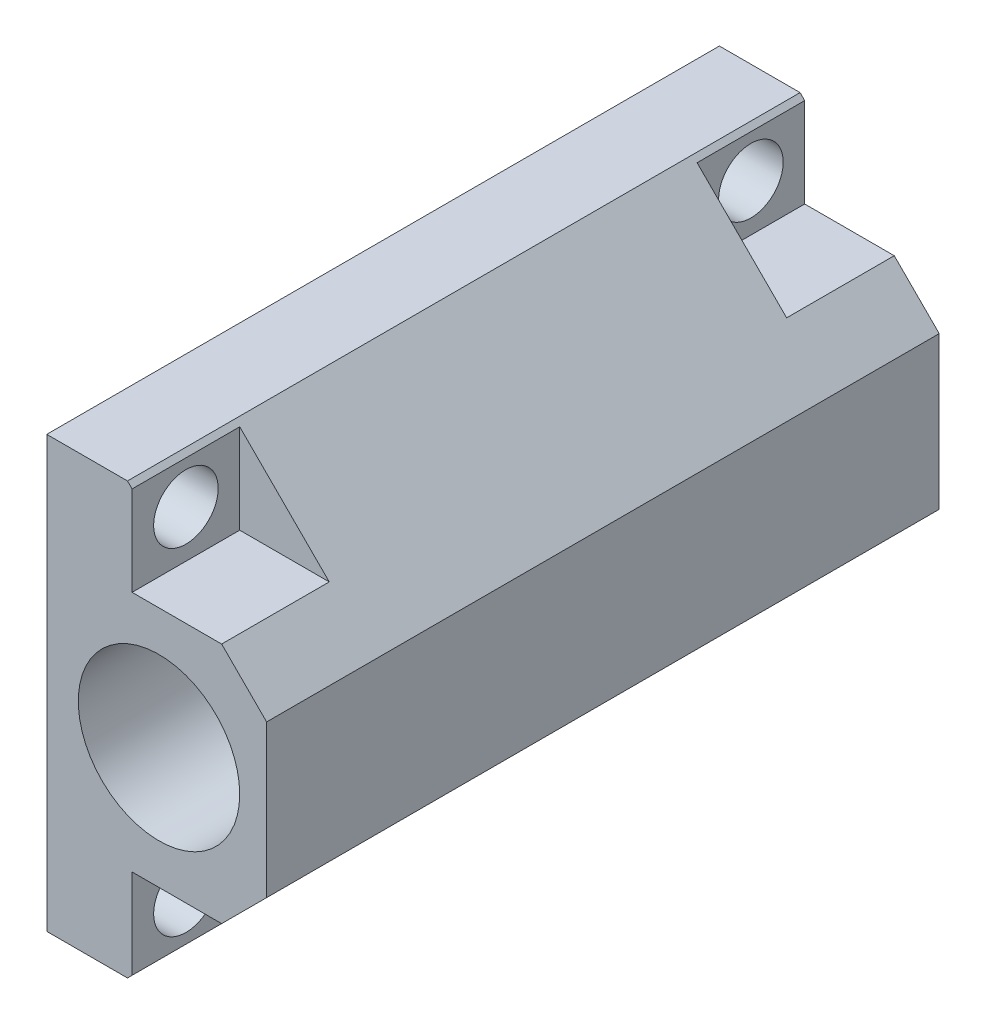
ISO-10303-21;
HEADER;
FILE_DESCRIPTION(('STEP AP214'),'2;1');
FILE_NAME('part.step','',(''),(''),'','','');
FILE_SCHEMA(('AUTOMOTIVE_DESIGN { 1 0 10303 214 1 1 1 1 }'));
ENDSEC;
DATA;
#1=APPLICATION_CONTEXT('core data for automotive mechanical design processes');
#2=APPLICATION_PROTOCOL_DEFINITION('international standard','automotive_design',2000,#1);
#3=PRODUCT_CONTEXT('',#1,'mechanical');
#4=PRODUCT('Part','Part','',(#3));
#5=PRODUCT_RELATED_PRODUCT_CATEGORY('part','',(#4));
#6=PRODUCT_DEFINITION_FORMATION('','',#4);
#7=PRODUCT_DEFINITION_CONTEXT('part definition',#1,'design');
#8=PRODUCT_DEFINITION('design','',#6,#7);
#9=PRODUCT_DEFINITION_SHAPE('','',#8);
#10=(LENGTH_UNIT() NAMED_UNIT(*) SI_UNIT(.MILLI.,.METRE.));
#11=(NAMED_UNIT(*) PLANE_ANGLE_UNIT() SI_UNIT($,.RADIAN.));
#12=(NAMED_UNIT(*) SI_UNIT($,.STERADIAN.) SOLID_ANGLE_UNIT());
#13=UNCERTAINTY_MEASURE_WITH_UNIT(LENGTH_MEASURE(1.E-05),#10,'distance_accuracy_value','');
#14=(GEOMETRIC_REPRESENTATION_CONTEXT(3) GLOBAL_UNCERTAINTY_ASSIGNED_CONTEXT((#13)) GLOBAL_UNIT_ASSIGNED_CONTEXT((#10,
#11,#12)) REPRESENTATION_CONTEXT('',''));
#15=CARTESIAN_POINT('',(0.,0.,0.));
#16=DIRECTION('',(0.,0.,1.));
#17=DIRECTION('',(1.,0.,0.));
#18=AXIS2_PLACEMENT_3D('',#15,#16,#17);
#19=CARTESIAN_POINT('',(0.,0.,25.));
#20=DIRECTION('',(0.,0.,-1.));
#21=DIRECTION('',(-1.,0.,0.));
#22=AXIS2_PLACEMENT_3D('',#19,#20,#21);
#23=PLANE('',#22);
#24=CARTESIAN_POINT('',(2.67157287525391,0.,25.));
#25=DIRECTION('',(0.,0.,1.));
#26=DIRECTION('',(1.,0.,0.));
#27=AXIS2_PLACEMENT_3D('',#24,#25,#26);
#28=CIRCLE('',#27,2.99999999999999);
#29=CARTESIAN_POINT('',(5.6715728752539,0.,25.));
#30=VERTEX_POINT('',#29);
#31=EDGE_CURVE('E255',#30,#30,#28,.T.);
#32=ORIENTED_EDGE('',*,*,#31,.F.);
#33=EDGE_LOOP('',(#32));
#34=FACE_BOUND('',#33,.T.);
#35=DIRECTION('',(1.,0.,0.));
#36=VECTOR('',#35,1.);
#37=CARTESIAN_POINT('',(1.6715728752539,4.49999999999999,25.));
#38=LINE('',#37,#36);
#39=CARTESIAN_POINT('',(1.6715728752539,4.49999999999999,25.));
#40=VERTEX_POINT('',#39);
#41=CARTESIAN_POINT('',(5.,4.5,25.));
#42=VERTEX_POINT('',#41);
#43=EDGE_CURVE('E204',#40,#42,#38,.T.);
#44=ORIENTED_EDGE('',*,*,#43,.F.);
#45=DIRECTION('',(0.,-1.,0.));
#46=VECTOR('',#45,1.);
#47=CARTESIAN_POINT('',(1.6715728752539,0.,25.));
#48=LINE('',#47,#46);
#49=CARTESIAN_POINT('',(1.67157287525389,7.82842712474611,25.));
#50=VERTEX_POINT('',#49);
#51=EDGE_CURVE('E218',#50,#40,#48,.T.);
#52=ORIENTED_EDGE('',*,*,#51,.F.);
#53=DIRECTION('',(-0.707106781186548,0.707106781186548,0.));
#54=VECTOR('',#53,1.);
#55=CARTESIAN_POINT('',(1.5,8.,25.));
#56=LINE('',#55,#54);
#57=CARTESIAN_POINT('',(1.5,8.,25.));
#58=VERTEX_POINT('',#57);
#59=EDGE_CURVE('E286',#50,#58,#56,.T.);
#60=ORIENTED_EDGE('',*,*,#59,.T.);
#61=DIRECTION('',(-1.,0.,0.));
#62=VECTOR('',#61,1.);
#63=CARTESIAN_POINT('',(-1.5,8.,25.));
#64=LINE('',#63,#62);
#65=CARTESIAN_POINT('',(-1.5,8.,25.));
#66=VERTEX_POINT('',#65);
#67=EDGE_CURVE('E290',#58,#66,#64,.T.);
#68=ORIENTED_EDGE('',*,*,#67,.T.);
#69=DIRECTION('',(0.,-1.,0.));
#70=VECTOR('',#69,1.);
#71=CARTESIAN_POINT('',(-1.5,-8.,25.));
#72=LINE('',#71,#70);
#73=CARTESIAN_POINT('',(-1.5,-8.,25.));
#74=VERTEX_POINT('',#73);
#75=EDGE_CURVE('E292',#66,#74,#72,.T.);
#76=ORIENTED_EDGE('',*,*,#75,.T.);
#77=DIRECTION('',(1.,0.,0.));
#78=VECTOR('',#77,1.);
#79=CARTESIAN_POINT('',(-1.5,-8.,25.));
#80=LINE('',#79,#78);
#81=CARTESIAN_POINT('',(1.5,-8.,25.));
#82=VERTEX_POINT('',#81);
#83=EDGE_CURVE('E295',#74,#82,#80,.T.);
#84=ORIENTED_EDGE('',*,*,#83,.T.);
#85=DIRECTION('',(0.707106781186556,0.707106781186539,0.));
#86=VECTOR('',#85,1.);
#87=CARTESIAN_POINT('',(9.5000000000001,0.,25.));
#88=LINE('',#87,#86);
#89=CARTESIAN_POINT('',(1.67157287525392,-7.82842712474609,25.));
#90=VERTEX_POINT('',#89);
#91=EDGE_CURVE('E283',#82,#90,#88,.T.);
#92=ORIENTED_EDGE('',*,*,#91,.T.);
#93=DIRECTION('',(0.,-1.,0.));
#94=VECTOR('',#93,1.);
#95=CARTESIAN_POINT('',(1.6715728752539,0.,25.));
#96=LINE('',#95,#94);
#97=CARTESIAN_POINT('',(1.67157287525391,-4.50000000000001,25.));
#98=VERTEX_POINT('',#97);
#99=EDGE_CURVE('E207',#98,#90,#96,.T.);
#100=ORIENTED_EDGE('',*,*,#99,.F.);
#101=DIRECTION('',(1.,0.,0.));
#102=VECTOR('',#101,1.);
#103=CARTESIAN_POINT('',(1.67157287525391,-4.50000000000001,25.));
#104=LINE('',#103,#102);
#105=CARTESIAN_POINT('',(5.00000000000008,-4.5,25.));
#106=VERTEX_POINT('',#105);
#107=EDGE_CURVE('E190',#98,#106,#104,.T.);
#108=ORIENTED_EDGE('',*,*,#107,.T.);
#109=CARTESIAN_POINT('',(6.67157287525391,-2.82842712474622,25.));
#110=VERTEX_POINT('',#109);
#111=EDGE_CURVE('E273',#106,#110,#88,.T.);
#112=ORIENTED_EDGE('',*,*,#111,.T.);
#113=DIRECTION('',(0.,-1.,0.));
#114=VECTOR('',#113,1.);
#115=CARTESIAN_POINT('',(6.67157287525391,-2.82842712474622,25.));
#116=LINE('',#115,#114);
#117=CARTESIAN_POINT('',(6.6715728752539,2.8284271247461,25.));
#118=VERTEX_POINT('',#117);
#119=EDGE_CURVE('E316',#110,#118,#116,.F.);
#120=ORIENTED_EDGE('',*,*,#119,.T.);
#121=EDGE_CURVE('E287',#118,#42,#56,.T.);
#122=ORIENTED_EDGE('',*,*,#121,.T.);
#123=EDGE_LOOP('',(#44,#52,#60,#68,#76,#84,#92,#100,#108,#112,#120,#122));
#124=FACE_BOUND('',#123,.T.);
#125=ADVANCED_FACE('F38',(#34,#124),#23,.F.);
#126=CARTESIAN_POINT('',(0.,0.,0.));
#127=DIRECTION('',(0.,0.,-1.));
#128=DIRECTION('',(-1.,0.,0.));
#129=AXIS2_PLACEMENT_3D('',#126,#127,#128);
#130=PLANE('',#129);
#131=CARTESIAN_POINT('',(2.67157287525391,0.,0.));
#132=DIRECTION('',(0.,0.,-1.));
#133=DIRECTION('',(-1.,0.,0.));
#134=AXIS2_PLACEMENT_3D('',#131,#132,#133);
#135=CIRCLE('',#134,2.99999999999999);
#136=CARTESIAN_POINT('',(-0.328427124746082,0.,0.));
#137=VERTEX_POINT('',#136);
#138=EDGE_CURVE('E249',#137,#137,#135,.T.);
#139=ORIENTED_EDGE('',*,*,#138,.F.);
#140=EDGE_LOOP('',(#139));
#141=FACE_BOUND('',#140,.T.);
#142=DIRECTION('',(0.707106781186556,0.707106781186539,0.));
#143=VECTOR('',#142,1.);
#144=CARTESIAN_POINT('',(9.5000000000001,0.,0.));
#145=LINE('',#144,#143);
#146=CARTESIAN_POINT('',(5.00000000000008,-4.5,0.));
#147=VERTEX_POINT('',#146);
#148=CARTESIAN_POINT('',(6.67157287525391,-2.82842712474622,0.));
#149=VERTEX_POINT('',#148);
#150=EDGE_CURVE('E278',#147,#149,#145,.T.);
#151=ORIENTED_EDGE('',*,*,#150,.F.);
#152=DIRECTION('',(1.,0.,0.));
#153=VECTOR('',#152,1.);
#154=CARTESIAN_POINT('',(1.67157287525391,-4.50000000000001,0.));
#155=LINE('',#154,#153);
#156=CARTESIAN_POINT('',(1.67157287525391,-4.50000000000001,0.));
#157=VERTEX_POINT('',#156);
#158=EDGE_CURVE('E182',#157,#147,#155,.T.);
#159=ORIENTED_EDGE('',*,*,#158,.F.);
#160=DIRECTION('',(0.,1.,0.));
#161=VECTOR('',#160,1.);
#162=CARTESIAN_POINT('',(1.6715728752539,0.,0.));
#163=LINE('',#162,#161);
#164=CARTESIAN_POINT('',(1.67157287525391,-7.82842712474609,0.));
#165=VERTEX_POINT('',#164);
#166=EDGE_CURVE('E183',#165,#157,#163,.T.);
#167=ORIENTED_EDGE('',*,*,#166,.F.);
#168=CARTESIAN_POINT('',(1.5,-8.,0.));
#169=VERTEX_POINT('',#168);
#170=EDGE_CURVE('E274',#169,#165,#145,.T.);
#171=ORIENTED_EDGE('',*,*,#170,.F.);
#172=DIRECTION('',(1.,0.,0.));
#173=VECTOR('',#172,1.);
#174=CARTESIAN_POINT('',(-1.5,-8.,0.));
#175=LINE('',#174,#173);
#176=CARTESIAN_POINT('',(-1.5,-8.,0.));
#177=VERTEX_POINT('',#176);
#178=EDGE_CURVE('E293',#177,#169,#175,.T.);
#179=ORIENTED_EDGE('',*,*,#178,.F.);
#180=DIRECTION('',(0.,-1.,0.));
#181=VECTOR('',#180,1.);
#182=CARTESIAN_POINT('',(-1.5,-8.,0.));
#183=LINE('',#182,#181);
#184=CARTESIAN_POINT('',(-1.5,8.,0.));
#185=VERTEX_POINT('',#184);
#186=EDGE_CURVE('E299',#185,#177,#183,.T.);
#187=ORIENTED_EDGE('',*,*,#186,.F.);
#188=DIRECTION('',(-1.,0.,0.));
#189=VECTOR('',#188,1.);
#190=CARTESIAN_POINT('',(-1.5,8.,0.));
#191=LINE('',#190,#189);
#192=CARTESIAN_POINT('',(1.5,8.,0.));
#193=VERTEX_POINT('',#192);
#194=EDGE_CURVE('E282',#193,#185,#191,.T.);
#195=ORIENTED_EDGE('',*,*,#194,.F.);
#196=DIRECTION('',(-0.707106781186548,0.707106781186548,0.));
#197=VECTOR('',#196,1.);
#198=CARTESIAN_POINT('',(1.5,8.,0.));
#199=LINE('',#198,#197);
#200=CARTESIAN_POINT('',(1.67157287525389,7.82842712474611,0.));
#201=VERTEX_POINT('',#200);
#202=EDGE_CURVE('E277',#201,#193,#199,.T.);
#203=ORIENTED_EDGE('',*,*,#202,.F.);
#204=DIRECTION('',(0.,1.,0.));
#205=VECTOR('',#204,1.);
#206=CARTESIAN_POINT('',(1.6715728752539,0.,0.));
#207=LINE('',#206,#205);
#208=CARTESIAN_POINT('',(1.6715728752539,4.49999999999999,0.));
#209=VERTEX_POINT('',#208);
#210=EDGE_CURVE('E61',#209,#201,#207,.T.);
#211=ORIENTED_EDGE('',*,*,#210,.F.);
#212=DIRECTION('',(1.,0.,0.));
#213=VECTOR('',#212,1.);
#214=CARTESIAN_POINT('',(1.6715728752539,4.49999999999999,0.));
#215=LINE('',#214,#213);
#216=CARTESIAN_POINT('',(5.,4.5,0.));
#217=VERTEX_POINT('',#216);
#218=EDGE_CURVE('E229',#209,#217,#215,.T.);
#219=ORIENTED_EDGE('',*,*,#218,.T.);
#220=CARTESIAN_POINT('',(6.6715728752539,2.8284271247461,0.));
#221=VERTEX_POINT('',#220);
#222=EDGE_CURVE('E279',#221,#217,#199,.T.);
#223=ORIENTED_EDGE('',*,*,#222,.F.);
#224=DIRECTION('',(0.,1.,0.));
#225=VECTOR('',#224,1.);
#226=CARTESIAN_POINT('',(6.6715728752539,0.,0.));
#227=LINE('',#226,#225);
#228=EDGE_CURVE('E320',#221,#149,#227,.F.);
#229=ORIENTED_EDGE('',*,*,#228,.T.);
#230=EDGE_LOOP('',(#151,#159,#167,#171,#179,#187,#195,#203,#211,#219,#223,#229));
#231=FACE_BOUND('',#230,.T.);
#232=ADVANCED_FACE('F366',(#141,#231),#130,.T.);
#233=CARTESIAN_POINT('',(1.5,8.,0.));
#234=DIRECTION('',(0.707106781186548,0.707106781186548,0.));
#235=DIRECTION('',(-0.707106781186548,0.707106781186548,0.));
#236=AXIS2_PLACEMENT_3D('',#233,#234,#235);
#237=PLANE('',#236);
#238=DIRECTION('',(-0.707106781186548,0.707106781186548,0.));
#239=VECTOR('',#238,1.);
#240=CARTESIAN_POINT('',(1.5,8.,21.));
#241=LINE('',#240,#239);
#242=CARTESIAN_POINT('',(5.,4.5,21.));
#243=VERTEX_POINT('',#242);
#244=CARTESIAN_POINT('',(1.67157287525389,7.82842712474611,21.));
#245=VERTEX_POINT('',#244);
#246=EDGE_CURVE('E46',#243,#245,#241,.T.);
#247=ORIENTED_EDGE('',*,*,#246,.F.);
#248=DIRECTION('',(0.,0.,1.));
#249=VECTOR('',#248,1.);
#250=CARTESIAN_POINT('',(5.,4.5,0.));
#251=LINE('',#250,#249);
#252=EDGE_CURVE('E11',#243,#42,#251,.T.);
#253=ORIENTED_EDGE('',*,*,#252,.T.);
#254=ORIENTED_EDGE('',*,*,#121,.F.);
#255=DIRECTION('',(0.,0.,-1.));
#256=VECTOR('',#255,1.);
#257=CARTESIAN_POINT('',(6.6715728752539,2.8284271247461,0.));
#258=LINE('',#257,#256);
#259=EDGE_CURVE('E318',#118,#221,#258,.T.);
#260=ORIENTED_EDGE('',*,*,#259,.T.);
#261=ORIENTED_EDGE('',*,*,#222,.T.);
#262=DIRECTION('',(0.,0.,-1.));
#263=VECTOR('',#262,1.);
#264=CARTESIAN_POINT('',(5.,4.5,0.));
#265=LINE('',#264,#263);
#266=CARTESIAN_POINT('',(5.,4.5,4.));
#267=VERTEX_POINT('',#266);
#268=EDGE_CURVE('E341',#267,#217,#265,.T.);
#269=ORIENTED_EDGE('',*,*,#268,.F.);
#270=DIRECTION('',(-0.707106781186548,0.707106781186548,0.));
#271=VECTOR('',#270,1.);
#272=CARTESIAN_POINT('',(1.5,8.,4.));
#273=LINE('',#272,#271);
#274=CARTESIAN_POINT('',(1.67157287525389,7.82842712474611,4.));
#275=VERTEX_POINT('',#274);
#276=EDGE_CURVE('E338',#267,#275,#273,.T.);
#277=ORIENTED_EDGE('',*,*,#276,.T.);
#278=DIRECTION('',(0.,0.,-1.));
#279=VECTOR('',#278,1.);
#280=CARTESIAN_POINT('',(1.67157287525389,7.82842712474611,0.));
#281=LINE('',#280,#279);
#282=EDGE_CURVE('E236',#275,#201,#281,.T.);
#283=ORIENTED_EDGE('',*,*,#282,.T.);
#284=ORIENTED_EDGE('',*,*,#202,.T.);
#285=DIRECTION('',(0.,0.,-1.));
#286=VECTOR('',#285,1.);
#287=CARTESIAN_POINT('',(1.5,8.,25.));
#288=LINE('',#287,#286);
#289=EDGE_CURVE('E310',#58,#193,#288,.T.);
#290=ORIENTED_EDGE('',*,*,#289,.F.);
#291=ORIENTED_EDGE('',*,*,#59,.F.);
#292=DIRECTION('',(0.,0.,-1.));
#293=VECTOR('',#292,1.);
#294=CARTESIAN_POINT('',(1.67157287525389,7.82842712474611,0.));
#295=LINE('',#294,#293);
#296=EDGE_CURVE('E243',#50,#245,#295,.T.);
#297=ORIENTED_EDGE('',*,*,#296,.T.);
#298=EDGE_LOOP('',(#247,#253,#254,#260,#261,#269,#277,#283,#284,#290,#291,#297));
#299=FACE_BOUND('',#298,.T.);
#300=ADVANCED_FACE('F347',(#299),#237,.T.);
#301=CARTESIAN_POINT('',(9.5000000000001,0.,0.));
#302=DIRECTION('',(0.707106781186539,-0.707106781186556,0.));
#303=DIRECTION('',(0.707106781186556,0.707106781186539,0.));
#304=AXIS2_PLACEMENT_3D('',#301,#302,#303);
#305=PLANE('',#304);
#306=DIRECTION('',(0.,0.,1.));
#307=VECTOR('',#306,1.);
#308=CARTESIAN_POINT('',(5.00000000000008,-4.5,0.));
#309=LINE('',#308,#307);
#310=CARTESIAN_POINT('',(5.00000000000008,-4.5,21.));
#311=VERTEX_POINT('',#310);
#312=EDGE_CURVE('E336',#311,#106,#309,.T.);
#313=ORIENTED_EDGE('',*,*,#312,.F.);
#314=DIRECTION('',(-0.707106781186556,-0.707106781186539,0.));
#315=VECTOR('',#314,1.);
#316=CARTESIAN_POINT('',(9.5000000000001,0.,21.));
#317=LINE('',#316,#315);
#318=CARTESIAN_POINT('',(1.67157287525391,-7.82842712474609,21.));
#319=VERTEX_POINT('',#318);
#320=EDGE_CURVE('E333',#311,#319,#317,.T.);
#321=ORIENTED_EDGE('',*,*,#320,.T.);
#322=DIRECTION('',(0.,0.,1.));
#323=VECTOR('',#322,1.);
#324=CARTESIAN_POINT('',(1.67157287525392,-7.82842712474609,0.));
#325=LINE('',#324,#323);
#326=EDGE_CURVE('E239',#319,#90,#325,.T.);
#327=ORIENTED_EDGE('',*,*,#326,.T.);
#328=ORIENTED_EDGE('',*,*,#91,.F.);
#329=DIRECTION('',(0.,0.,-1.));
#330=VECTOR('',#329,1.);
#331=CARTESIAN_POINT('',(1.5,-8.,25.));
#332=LINE('',#331,#330);
#333=EDGE_CURVE('E297',#82,#169,#332,.T.);
#334=ORIENTED_EDGE('',*,*,#333,.T.);
#335=ORIENTED_EDGE('',*,*,#170,.T.);
#336=DIRECTION('',(0.,0.,1.));
#337=VECTOR('',#336,1.);
#338=CARTESIAN_POINT('',(1.67157287525392,-7.82842712474609,0.));
#339=LINE('',#338,#337);
#340=CARTESIAN_POINT('',(1.67157287525392,-7.82842712474609,4.));
#341=VERTEX_POINT('',#340);
#342=EDGE_CURVE('E247',#165,#341,#339,.T.);
#343=ORIENTED_EDGE('',*,*,#342,.T.);
#344=DIRECTION('',(-0.707106781186556,-0.707106781186539,0.));
#345=VECTOR('',#344,1.);
#346=CARTESIAN_POINT('',(9.5000000000001,0.,4.));
#347=LINE('',#346,#345);
#348=CARTESIAN_POINT('',(5.00000000000008,-4.5,4.));
#349=VERTEX_POINT('',#348);
#350=EDGE_CURVE('E193',#349,#341,#347,.T.);
#351=ORIENTED_EDGE('',*,*,#350,.F.);
#352=DIRECTION('',(0.,0.,-1.));
#353=VECTOR('',#352,1.);
#354=CARTESIAN_POINT('',(5.00000000000008,-4.5,0.));
#355=LINE('',#354,#353);
#356=EDGE_CURVE('E177',#349,#147,#355,.T.);
#357=ORIENTED_EDGE('',*,*,#356,.T.);
#358=ORIENTED_EDGE('',*,*,#150,.T.);
#359=DIRECTION('',(0.,0.,1.));
#360=VECTOR('',#359,1.);
#361=CARTESIAN_POINT('',(6.67157287525391,-2.82842712474622,0.));
#362=LINE('',#361,#360);
#363=EDGE_CURVE('E313',#149,#110,#362,.T.);
#364=ORIENTED_EDGE('',*,*,#363,.T.);
#365=ORIENTED_EDGE('',*,*,#111,.F.);
#366=EDGE_LOOP('',(#313,#321,#327,#328,#334,#335,#343,#351,#357,#358,#364,#365));
#367=FACE_BOUND('',#366,.T.);
#368=ADVANCED_FACE('F396',(#367),#305,.T.);
#369=CARTESIAN_POINT('',(-1.5,-6.25,2.));
#370=DIRECTION('',(-1.,0.,0.));
#371=DIRECTION('',(0.,0.,1.));
#372=AXIS2_PLACEMENT_3D('',#369,#370,#371);
#373=CYLINDRICAL_SURFACE('',#372,1.2);
#374=CARTESIAN_POINT('',(-1.5,-6.25,2.));
#375=DIRECTION('',(-1.,0.,0.));
#376=DIRECTION('',(0.,0.,1.));
#377=AXIS2_PLACEMENT_3D('',#374,#375,#376);
#378=CIRCLE('',#377,1.2);
#379=CARTESIAN_POINT('',(-1.5,-6.25,3.2));
#380=VERTEX_POINT('',#379);
#381=EDGE_CURVE('E270',#380,#380,#378,.T.);
#382=ORIENTED_EDGE('',*,*,#381,.T.);
#383=EDGE_LOOP('',(#382));
#384=FACE_BOUND('',#383,.T.);
#385=CARTESIAN_POINT('',(1.67157287525391,-6.25,2.));
#386=DIRECTION('',(1.,0.,0.));
#387=DIRECTION('',(0.,1.,0.));
#388=AXIS2_PLACEMENT_3D('',#385,#386,#387);
#389=CIRCLE('',#388,1.2);
#390=CARTESIAN_POINT('',(1.67157287525391,-5.05,2.));
#391=VERTEX_POINT('',#390);
#392=EDGE_CURVE('E246',#391,#391,#389,.F.);
#393=ORIENTED_EDGE('',*,*,#392,.F.);
#394=EDGE_LOOP('',(#393));
#395=FACE_BOUND('',#394,.T.);
#396=ADVANCED_FACE('F575',(#384,#395),#373,.F.);
#397=CARTESIAN_POINT('',(-1.5,6.25,23.));
#398=DIRECTION('',(-1.,0.,0.));
#399=DIRECTION('',(0.,0.,1.));
#400=AXIS2_PLACEMENT_3D('',#397,#398,#399);
#401=CYLINDRICAL_SURFACE('',#400,1.2);
#402=CARTESIAN_POINT('',(-1.5,6.25,23.));
#403=DIRECTION('',(-1.,0.,0.));
#404=DIRECTION('',(0.,0.,1.));
#405=AXIS2_PLACEMENT_3D('',#402,#403,#404);
#406=CIRCLE('',#405,1.2);
#407=CARTESIAN_POINT('',(-1.5,6.25,24.2));
#408=VERTEX_POINT('',#407);
#409=EDGE_CURVE('E267',#408,#408,#406,.T.);
#410=ORIENTED_EDGE('',*,*,#409,.T.);
#411=EDGE_LOOP('',(#410));
#412=FACE_BOUND('',#411,.T.);
#413=CARTESIAN_POINT('',(1.67157287525389,6.25,23.));
#414=DIRECTION('',(1.,0.,0.));
#415=DIRECTION('',(0.,1.,0.));
#416=AXIS2_PLACEMENT_3D('',#413,#414,#415);
#417=CIRCLE('',#416,1.2);
#418=CARTESIAN_POINT('',(1.67157287525389,7.45,23.));
#419=VERTEX_POINT('',#418);
#420=EDGE_CURVE('E242',#419,#419,#417,.F.);
#421=ORIENTED_EDGE('',*,*,#420,.F.);
#422=EDGE_LOOP('',(#421));
#423=FACE_BOUND('',#422,.T.);
#424=ADVANCED_FACE('F571',(#412,#423),#401,.F.);
#425=CARTESIAN_POINT('',(-1.5,-6.25,23.));
#426=DIRECTION('',(-1.,0.,0.));
#427=DIRECTION('',(0.,0.,1.));
#428=AXIS2_PLACEMENT_3D('',#425,#426,#427);
#429=CYLINDRICAL_SURFACE('',#428,1.2);
#430=CARTESIAN_POINT('',(-1.5,-6.25,23.));
#431=DIRECTION('',(-1.,0.,0.));
#432=DIRECTION('',(0.,0.,1.));
#433=AXIS2_PLACEMENT_3D('',#430,#431,#432);
#434=CIRCLE('',#433,1.2);
#435=CARTESIAN_POINT('',(-1.5,-6.25,24.2));
#436=VERTEX_POINT('',#435);
#437=EDGE_CURVE('E264',#436,#436,#434,.T.);
#438=ORIENTED_EDGE('',*,*,#437,.T.);
#439=EDGE_LOOP('',(#438));
#440=FACE_BOUND('',#439,.T.);
#441=CARTESIAN_POINT('',(1.67157287525391,-6.25,23.));
#442=DIRECTION('',(1.,0.,0.));
#443=DIRECTION('',(0.,1.,0.));
#444=AXIS2_PLACEMENT_3D('',#441,#442,#443);
#445=CIRCLE('',#444,1.2);
#446=CARTESIAN_POINT('',(1.67157287525391,-5.05,23.));
#447=VERTEX_POINT('',#446);
#448=EDGE_CURVE('E238',#447,#447,#445,.F.);
#449=ORIENTED_EDGE('',*,*,#448,.F.);
#450=EDGE_LOOP('',(#449));
#451=FACE_BOUND('',#450,.T.);
#452=ADVANCED_FACE('F567',(#440,#451),#429,.F.);
#453=CARTESIAN_POINT('',(-1.5,6.25,2.));
#454=DIRECTION('',(-1.,0.,0.));
#455=DIRECTION('',(0.,0.,1.));
#456=AXIS2_PLACEMENT_3D('',#453,#454,#455);
#457=CYLINDRICAL_SURFACE('',#456,1.2);
#458=CARTESIAN_POINT('',(-1.5,6.25,2.));
#459=DIRECTION('',(-1.,0.,0.));
#460=DIRECTION('',(0.,0.,1.));
#461=AXIS2_PLACEMENT_3D('',#458,#459,#460);
#462=CIRCLE('',#461,1.2);
#463=CARTESIAN_POINT('',(-1.5,6.25,3.2));
#464=VERTEX_POINT('',#463);
#465=EDGE_CURVE('E261',#464,#464,#462,.T.);
#466=ORIENTED_EDGE('',*,*,#465,.T.);
#467=EDGE_LOOP('',(#466));
#468=FACE_BOUND('',#467,.T.);
#469=CARTESIAN_POINT('',(1.67157287525389,6.25,2.));
#470=DIRECTION('',(1.,0.,0.));
#471=DIRECTION('',(0.,1.,0.));
#472=AXIS2_PLACEMENT_3D('',#469,#470,#471);
#473=CIRCLE('',#472,1.2);
#474=CARTESIAN_POINT('',(1.67157287525389,7.45,2.));
#475=VERTEX_POINT('',#474);
#476=EDGE_CURVE('E233',#475,#475,#473,.F.);
#477=ORIENTED_EDGE('',*,*,#476,.F.);
#478=EDGE_LOOP('',(#477));
#479=FACE_BOUND('',#478,.T.);
#480=ADVANCED_FACE('F432',(#468,#479),#457,.F.);
#481=CARTESIAN_POINT('',(-1.5,-8.,25.));
#482=DIRECTION('',(1.,0.,0.));
#483=DIRECTION('',(0.,0.,-1.));
#484=AXIS2_PLACEMENT_3D('',#481,#482,#483);
#485=PLANE('',#484);
#486=ORIENTED_EDGE('',*,*,#465,.F.);
#487=EDGE_LOOP('',(#486));
#488=FACE_BOUND('',#487,.T.);
#489=ORIENTED_EDGE('',*,*,#437,.F.);
#490=EDGE_LOOP('',(#489));
#491=FACE_BOUND('',#490,.T.);
#492=ORIENTED_EDGE('',*,*,#381,.F.);
#493=EDGE_LOOP('',(#492));
#494=FACE_BOUND('',#493,.T.);
#495=ORIENTED_EDGE('',*,*,#186,.T.);
#496=DIRECTION('',(0.,0.,-1.));
#497=VECTOR('',#496,1.);
#498=CARTESIAN_POINT('',(-1.5,-8.,25.));
#499=LINE('',#498,#497);
#500=EDGE_CURVE('E304',#74,#177,#499,.T.);
#501=ORIENTED_EDGE('',*,*,#500,.F.);
#502=ORIENTED_EDGE('',*,*,#75,.F.);
#503=DIRECTION('',(0.,0.,-1.));
#504=VECTOR('',#503,1.);
#505=CARTESIAN_POINT('',(-1.5,8.,25.));
#506=LINE('',#505,#504);
#507=EDGE_CURVE('E307',#66,#185,#506,.T.);
#508=ORIENTED_EDGE('',*,*,#507,.T.);
#509=EDGE_LOOP('',(#495,#501,#502,#508));
#510=FACE_BOUND('',#509,.T.);
#511=ORIENTED_EDGE('',*,*,#409,.F.);
#512=EDGE_LOOP('',(#511));
#513=FACE_BOUND('',#512,.T.);
#514=ADVANCED_FACE('F388',(#488,#491,#494,#510,#513),#485,.F.);
#515=CARTESIAN_POINT('',(-1.5,8.,25.));
#516=DIRECTION('',(0.,-1.,0.));
#517=DIRECTION('',(0.,0.,-1.));
#518=AXIS2_PLACEMENT_3D('',#515,#516,#517);
#519=PLANE('',#518);
#520=ORIENTED_EDGE('',*,*,#194,.T.);
#521=ORIENTED_EDGE('',*,*,#507,.F.);
#522=ORIENTED_EDGE('',*,*,#67,.F.);
#523=ORIENTED_EDGE('',*,*,#289,.T.);
#524=EDGE_LOOP('',(#520,#521,#522,#523));
#525=FACE_BOUND('',#524,.T.);
#526=ADVANCED_FACE('F382',(#525),#519,.F.);
#527=CARTESIAN_POINT('',(-1.5,-8.,25.));
#528=DIRECTION('',(0.,1.,0.));
#529=DIRECTION('',(0.,0.,1.));
#530=AXIS2_PLACEMENT_3D('',#527,#528,#529);
#531=PLANE('',#530);
#532=ORIENTED_EDGE('',*,*,#178,.T.);
#533=ORIENTED_EDGE('',*,*,#333,.F.);
#534=ORIENTED_EDGE('',*,*,#83,.F.);
#535=ORIENTED_EDGE('',*,*,#500,.T.);
#536=EDGE_LOOP('',(#532,#533,#534,#535));
#537=FACE_BOUND('',#536,.T.);
#538=ADVANCED_FACE('F391',(#537),#531,.F.);
#539=CARTESIAN_POINT('',(6.67157287525391,-2.82842712474622,0.));
#540=DIRECTION('',(-1.,0.,0.));
#541=DIRECTION('',(0.,0.,1.));
#542=AXIS2_PLACEMENT_3D('',#539,#540,#541);
#543=PLANE('',#542);
#544=ORIENTED_EDGE('',*,*,#228,.F.);
#545=ORIENTED_EDGE('',*,*,#259,.F.);
#546=ORIENTED_EDGE('',*,*,#119,.F.);
#547=ORIENTED_EDGE('',*,*,#363,.F.);
#548=EDGE_LOOP('',(#544,#545,#546,#547));
#549=FACE_BOUND('',#548,.T.);
#550=ADVANCED_FACE('F40',(#549),#543,.F.);
#551=CARTESIAN_POINT('',(2.67157287525391,0.,17.));
#552=DIRECTION('',(0.,0.,1.));
#553=DIRECTION('',(1.,0.,0.));
#554=AXIS2_PLACEMENT_3D('',#551,#552,#553);
#555=CONICAL_SURFACE('',#554,3.,1.02974425867665);
#556=CARTESIAN_POINT('',(2.67157287525391,0.,15.1974181429173));
#557=VERTEX_POINT('',#556);
#558=VERTEX_LOOP('',#557);
#559=FACE_BOUND('',#558,.T.);
#560=CARTESIAN_POINT('',(2.67157287525391,0.,17.));
#561=DIRECTION('',(0.,0.,1.));
#562=DIRECTION('',(1.,0.,0.));
#563=AXIS2_PLACEMENT_3D('',#560,#561,#562);
#564=CIRCLE('',#563,3.);
#565=CARTESIAN_POINT('',(5.67157287525391,0.,17.));
#566=VERTEX_POINT('',#565);
#567=EDGE_CURVE('E258',#566,#566,#564,.T.);
#568=ORIENTED_EDGE('',*,*,#567,.T.);
#569=EDGE_LOOP('',(#568));
#570=FACE_BOUND('',#569,.T.);
#571=ADVANCED_FACE('F450',(#559,#570),#555,.F.);
#572=CARTESIAN_POINT('',(2.67157287525391,0.,25.));
#573=DIRECTION('',(0.,0.,1.));
#574=DIRECTION('',(1.,0.,0.));
#575=AXIS2_PLACEMENT_3D('',#572,#573,#574);
#576=CYLINDRICAL_SURFACE('',#575,2.99999999999999);
#577=ORIENTED_EDGE('',*,*,#567,.F.);
#578=EDGE_LOOP('',(#577));
#579=FACE_BOUND('',#578,.T.);
#580=ORIENTED_EDGE('',*,*,#31,.T.);
#581=EDGE_LOOP('',(#580));
#582=FACE_BOUND('',#581,.T.);
#583=ADVANCED_FACE('F456',(#579,#582),#576,.F.);
#584=CARTESIAN_POINT('',(2.67157287525391,0.,8.));
#585=DIRECTION('',(0.,0.,-1.));
#586=DIRECTION('',(-1.,0.,0.));
#587=AXIS2_PLACEMENT_3D('',#584,#585,#586);
#588=CONICAL_SURFACE('',#587,3.,1.02974425867665);
#589=CARTESIAN_POINT('',(2.67157287525391,0.,9.80258185708268));
#590=VERTEX_POINT('',#589);
#591=VERTEX_LOOP('',#590);
#592=FACE_BOUND('',#591,.T.);
#593=CARTESIAN_POINT('',(2.67157287525391,0.,8.));
#594=DIRECTION('',(0.,0.,-1.));
#595=DIRECTION('',(-1.,0.,0.));
#596=AXIS2_PLACEMENT_3D('',#593,#594,#595);
#597=CIRCLE('',#596,3.);
#598=CARTESIAN_POINT('',(-0.328427124746089,0.,8.));
#599=VERTEX_POINT('',#598);
#600=EDGE_CURVE('E252',#599,#599,#597,.T.);
#601=ORIENTED_EDGE('',*,*,#600,.T.);
#602=EDGE_LOOP('',(#601));
#603=FACE_BOUND('',#602,.T.);
#604=ADVANCED_FACE('F464',(#592,#603),#588,.F.);
#605=CARTESIAN_POINT('',(2.67157287525391,0.,0.));
#606=DIRECTION('',(0.,0.,-1.));
#607=DIRECTION('',(-1.,0.,0.));
#608=AXIS2_PLACEMENT_3D('',#605,#606,#607);
#609=CYLINDRICAL_SURFACE('',#608,2.99999999999999);
#610=ORIENTED_EDGE('',*,*,#600,.F.);
#611=EDGE_LOOP('',(#610));
#612=FACE_BOUND('',#611,.T.);
#613=ORIENTED_EDGE('',*,*,#138,.T.);
#614=EDGE_LOOP('',(#613));
#615=FACE_BOUND('',#614,.T.);
#616=ADVANCED_FACE('F472',(#612,#615),#609,.F.);
#617=CARTESIAN_POINT('',(1.6715728752539,0.,0.));
#618=DIRECTION('',(1.,0.,0.));
#619=DIRECTION('',(0.,1.,0.));
#620=AXIS2_PLACEMENT_3D('',#617,#618,#619);
#621=PLANE('',#620);
#622=DIRECTION('',(0.,1.,0.));
#623=VECTOR('',#622,1.);
#624=CARTESIAN_POINT('',(1.6715728752539,0.,4.));
#625=LINE('',#624,#623);
#626=CARTESIAN_POINT('',(1.6715728752539,4.49999999999999,4.));
#627=VERTEX_POINT('',#626);
#628=EDGE_CURVE('E226',#627,#275,#625,.T.);
#629=ORIENTED_EDGE('',*,*,#628,.F.);
#630=DIRECTION('',(0.,0.,-1.));
#631=VECTOR('',#630,1.);
#632=CARTESIAN_POINT('',(1.6715728752539,4.49999999999999,0.));
#633=LINE('',#632,#631);
#634=EDGE_CURVE('E198',#627,#209,#633,.T.);
#635=ORIENTED_EDGE('',*,*,#634,.T.);
#636=ORIENTED_EDGE('',*,*,#210,.T.);
#637=ORIENTED_EDGE('',*,*,#282,.F.);
#638=EDGE_LOOP('',(#629,#635,#636,#637));
#639=FACE_BOUND('',#638,.T.);
#640=ORIENTED_EDGE('',*,*,#476,.T.);
#641=EDGE_LOOP('',(#640));
#642=FACE_BOUND('',#641,.T.);
#643=ADVANCED_FACE('F374',(#639,#642),#621,.T.);
#644=CARTESIAN_POINT('',(1.6715728752539,4.49999999999999,0.));
#645=DIRECTION('',(0.,-1.,0.));
#646=DIRECTION('',(1.,0.,0.));
#647=AXIS2_PLACEMENT_3D('',#644,#645,#646);
#648=PLANE('',#647);
#649=ORIENTED_EDGE('',*,*,#268,.T.);
#650=ORIENTED_EDGE('',*,*,#218,.F.);
#651=ORIENTED_EDGE('',*,*,#634,.F.);
#652=DIRECTION('',(1.,0.,0.));
#653=VECTOR('',#652,1.);
#654=CARTESIAN_POINT('',(1.6715728752539,4.49999999999999,4.));
#655=LINE('',#654,#653);
#656=EDGE_CURVE('E230',#627,#267,#655,.T.);
#657=ORIENTED_EDGE('',*,*,#656,.T.);
#658=EDGE_LOOP('',(#649,#650,#651,#657));
#659=FACE_BOUND('',#658,.T.);
#660=ADVANCED_FACE('F369',(#659),#648,.F.);
#661=CARTESIAN_POINT('',(1.6715728752539,0.,4.));
#662=DIRECTION('',(0.,0.,-1.));
#663=DIRECTION('',(-1.,0.,0.));
#664=AXIS2_PLACEMENT_3D('',#661,#662,#663);
#665=PLANE('',#664);
#666=ORIENTED_EDGE('',*,*,#656,.F.);
#667=ORIENTED_EDGE('',*,*,#628,.T.);
#668=ORIENTED_EDGE('',*,*,#276,.F.);
#669=EDGE_LOOP('',(#666,#667,#668));
#670=FACE_BOUND('',#669,.T.);
#671=ADVANCED_FACE('F373',(#670),#665,.T.);
#672=CARTESIAN_POINT('',(1.6715728752539,0.,0.));
#673=DIRECTION('',(1.,0.,0.));
#674=DIRECTION('',(0.,1.,0.));
#675=AXIS2_PLACEMENT_3D('',#672,#673,#674);
#676=PLANE('',#675);
#677=DIRECTION('',(0.,-1.,0.));
#678=VECTOR('',#677,1.);
#679=CARTESIAN_POINT('',(1.6715728752539,0.,21.));
#680=LINE('',#679,#678);
#681=CARTESIAN_POINT('',(1.67157287525391,-4.50000000000001,21.));
#682=VERTEX_POINT('',#681);
#683=EDGE_CURVE('E200',#682,#319,#680,.T.);
#684=ORIENTED_EDGE('',*,*,#683,.F.);
#685=DIRECTION('',(0.,0.,1.));
#686=VECTOR('',#685,1.);
#687=CARTESIAN_POINT('',(1.67157287525391,-4.50000000000001,0.));
#688=LINE('',#687,#686);
#689=EDGE_CURVE('E203',#682,#98,#688,.T.);
#690=ORIENTED_EDGE('',*,*,#689,.T.);
#691=ORIENTED_EDGE('',*,*,#99,.T.);
#692=ORIENTED_EDGE('',*,*,#326,.F.);
#693=EDGE_LOOP('',(#684,#690,#691,#692));
#694=FACE_BOUND('',#693,.T.);
#695=ORIENTED_EDGE('',*,*,#448,.T.);
#696=EDGE_LOOP('',(#695));
#697=FACE_BOUND('',#696,.T.);
#698=ADVANCED_FACE('F401',(#694,#697),#676,.T.);
#699=CARTESIAN_POINT('',(1.6715728752539,0.,21.));
#700=DIRECTION('',(0.,0.,1.));
#701=DIRECTION('',(1.,0.,0.));
#702=AXIS2_PLACEMENT_3D('',#699,#700,#701);
#703=PLANE('',#702);
#704=DIRECTION('',(1.,0.,0.));
#705=VECTOR('',#704,1.);
#706=CARTESIAN_POINT('',(1.67157287525391,-4.50000000000001,21.));
#707=LINE('',#706,#705);
#708=EDGE_CURVE('E209',#682,#311,#707,.T.);
#709=ORIENTED_EDGE('',*,*,#708,.F.);
#710=ORIENTED_EDGE('',*,*,#683,.T.);
#711=ORIENTED_EDGE('',*,*,#320,.F.);
#712=EDGE_LOOP('',(#709,#710,#711));
#713=FACE_BOUND('',#712,.T.);
#714=ADVANCED_FACE('F407',(#713),#703,.T.);
#715=CARTESIAN_POINT('',(1.67157287525391,-4.50000000000001,0.));
#716=DIRECTION('',(0.,1.,0.));
#717=DIRECTION('',(-1.,0.,0.));
#718=AXIS2_PLACEMENT_3D('',#715,#716,#717);
#719=PLANE('',#718);
#720=ORIENTED_EDGE('',*,*,#312,.T.);
#721=ORIENTED_EDGE('',*,*,#107,.F.);
#722=ORIENTED_EDGE('',*,*,#689,.F.);
#723=ORIENTED_EDGE('',*,*,#708,.T.);
#724=EDGE_LOOP('',(#720,#721,#722,#723));
#725=FACE_BOUND('',#724,.T.);
#726=ADVANCED_FACE('F405',(#725),#719,.F.);
#727=CARTESIAN_POINT('',(1.6715728752539,0.,0.));
#728=DIRECTION('',(1.,0.,0.));
#729=DIRECTION('',(0.,1.,0.));
#730=AXIS2_PLACEMENT_3D('',#727,#728,#729);
#731=PLANE('',#730);
#732=ORIENTED_EDGE('',*,*,#51,.T.);
#733=DIRECTION('',(0.,0.,1.));
#734=VECTOR('',#733,1.);
#735=CARTESIAN_POINT('',(1.6715728752539,4.49999999999999,0.));
#736=LINE('',#735,#734);
#737=CARTESIAN_POINT('',(1.6715728752539,4.49999999999999,21.));
#738=VERTEX_POINT('',#737);
#739=EDGE_CURVE('E214',#738,#40,#736,.T.);
#740=ORIENTED_EDGE('',*,*,#739,.F.);
#741=DIRECTION('',(0.,1.,0.));
#742=VECTOR('',#741,1.);
#743=CARTESIAN_POINT('',(1.6715728752539,0.,21.));
#744=LINE('',#743,#742);
#745=EDGE_CURVE('E53',#738,#245,#744,.T.);
#746=ORIENTED_EDGE('',*,*,#745,.T.);
#747=ORIENTED_EDGE('',*,*,#296,.F.);
#748=EDGE_LOOP('',(#732,#740,#746,#747));
#749=FACE_BOUND('',#748,.T.);
#750=ORIENTED_EDGE('',*,*,#420,.T.);
#751=EDGE_LOOP('',(#750));
#752=FACE_BOUND('',#751,.T.);
#753=ADVANCED_FACE('F350',(#749,#752),#731,.T.);
#754=CARTESIAN_POINT('',(1.6715728752539,4.49999999999999,0.));
#755=DIRECTION('',(0.,1.,0.));
#756=DIRECTION('',(-1.,0.,0.));
#757=AXIS2_PLACEMENT_3D('',#754,#755,#756);
#758=PLANE('',#757);
#759=DIRECTION('',(1.,0.,0.));
#760=VECTOR('',#759,1.);
#761=CARTESIAN_POINT('',(1.6715728752539,4.49999999999999,21.));
#762=LINE('',#761,#760);
#763=EDGE_CURVE('E220',#738,#243,#762,.T.);
#764=ORIENTED_EDGE('',*,*,#763,.F.);
#765=ORIENTED_EDGE('',*,*,#739,.T.);
#766=ORIENTED_EDGE('',*,*,#43,.T.);
#767=ORIENTED_EDGE('',*,*,#252,.F.);
#768=EDGE_LOOP('',(#764,#765,#766,#767));
#769=FACE_BOUND('',#768,.T.);
#770=ADVANCED_FACE('F357',(#769),#758,.T.);
#771=CARTESIAN_POINT('',(1.6715728752539,0.,21.));
#772=DIRECTION('',(0.,0.,-1.));
#773=DIRECTION('',(-1.,0.,0.));
#774=AXIS2_PLACEMENT_3D('',#771,#772,#773);
#775=PLANE('',#774);
#776=ORIENTED_EDGE('',*,*,#246,.T.);
#777=ORIENTED_EDGE('',*,*,#745,.F.);
#778=ORIENTED_EDGE('',*,*,#763,.T.);
#779=EDGE_LOOP('',(#776,#777,#778));
#780=FACE_BOUND('',#779,.T.);
#781=ADVANCED_FACE('F344',(#780),#775,.F.);
#782=CARTESIAN_POINT('',(1.6715728752539,0.,0.));
#783=DIRECTION('',(1.,0.,0.));
#784=DIRECTION('',(0.,1.,0.));
#785=AXIS2_PLACEMENT_3D('',#782,#783,#784);
#786=PLANE('',#785);
#787=ORIENTED_EDGE('',*,*,#166,.T.);
#788=DIRECTION('',(0.,0.,-1.));
#789=VECTOR('',#788,1.);
#790=CARTESIAN_POINT('',(1.67157287525391,-4.50000000000001,0.));
#791=LINE('',#790,#789);
#792=CARTESIAN_POINT('',(1.67157287525391,-4.50000000000001,4.));
#793=VERTEX_POINT('',#792);
#794=EDGE_CURVE('E174',#793,#157,#791,.T.);
#795=ORIENTED_EDGE('',*,*,#794,.F.);
#796=DIRECTION('',(0.,-1.,0.));
#797=VECTOR('',#796,1.);
#798=CARTESIAN_POINT('',(1.6715728752539,0.,4.));
#799=LINE('',#798,#797);
#800=EDGE_CURVE('E188',#793,#341,#799,.T.);
#801=ORIENTED_EDGE('',*,*,#800,.T.);
#802=ORIENTED_EDGE('',*,*,#342,.F.);
#803=EDGE_LOOP('',(#787,#795,#801,#802));
#804=FACE_BOUND('',#803,.T.);
#805=ORIENTED_EDGE('',*,*,#392,.T.);
#806=EDGE_LOOP('',(#805));
#807=FACE_BOUND('',#806,.T.);
#808=ADVANCED_FACE('F186',(#804,#807),#786,.T.);
#809=CARTESIAN_POINT('',(1.67157287525391,-4.50000000000001,0.));
#810=DIRECTION('',(0.,-1.,0.));
#811=DIRECTION('',(1.,0.,0.));
#812=AXIS2_PLACEMENT_3D('',#809,#810,#811);
#813=PLANE('',#812);
#814=DIRECTION('',(1.,0.,0.));
#815=VECTOR('',#814,1.);
#816=CARTESIAN_POINT('',(1.67157287525391,-4.50000000000001,4.));
#817=LINE('',#816,#815);
#818=EDGE_CURVE('E171',#793,#349,#817,.T.);
#819=ORIENTED_EDGE('',*,*,#818,.F.);
#820=ORIENTED_EDGE('',*,*,#794,.T.);
#821=ORIENTED_EDGE('',*,*,#158,.T.);
#822=ORIENTED_EDGE('',*,*,#356,.F.);
#823=EDGE_LOOP('',(#819,#820,#821,#822));
#824=FACE_BOUND('',#823,.T.);
#825=ADVANCED_FACE('F173',(#824),#813,.T.);
#826=CARTESIAN_POINT('',(1.6715728752539,0.,4.));
#827=DIRECTION('',(0.,0.,1.));
#828=DIRECTION('',(1.,0.,0.));
#829=AXIS2_PLACEMENT_3D('',#826,#827,#828);
#830=PLANE('',#829);
#831=ORIENTED_EDGE('',*,*,#350,.T.);
#832=ORIENTED_EDGE('',*,*,#800,.F.);
#833=ORIENTED_EDGE('',*,*,#818,.T.);
#834=EDGE_LOOP('',(#831,#832,#833));
#835=FACE_BOUND('',#834,.T.);
#836=ADVANCED_FACE('F192',(#835),#830,.F.);
#837=CLOSED_SHELL('',(#125,#232,#300,#368,#396,#424,#452,#480,#514,#526,#538,#550,#571,#583,
#604,#616,#643,#660,#671,#698,#714,#726,#753,#770,#781,#808,#825,#836));
#838=MANIFOLD_SOLID_BREP('B2',#837);
#839=ADVANCED_BREP_SHAPE_REPRESENTATION('',(#18,#838),#14);
#840=SHAPE_DEFINITION_REPRESENTATION(#9,#839);
ENDSEC;
END-ISO-10303-21;
